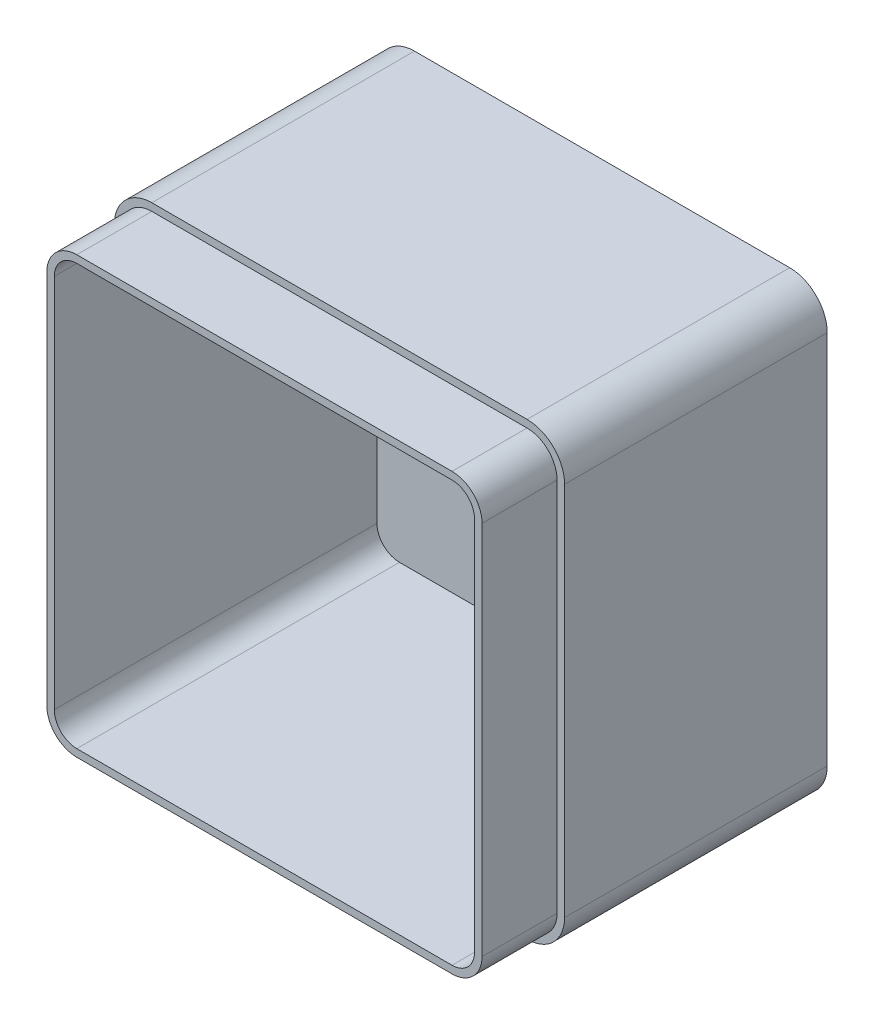
ISO-10303-21;
HEADER;
FILE_DESCRIPTION(('STEP AP214'),'2;1');
FILE_NAME('part.step','',(''),(''),'','','');
FILE_SCHEMA(('AUTOMOTIVE_DESIGN { 1 0 10303 214 1 1 1 1 }'));
ENDSEC;
DATA;
#1=APPLICATION_CONTEXT('core data for automotive mechanical design processes');
#2=APPLICATION_PROTOCOL_DEFINITION('international standard','automotive_design',2000,#1);
#3=PRODUCT_CONTEXT('',#1,'mechanical');
#4=PRODUCT('Part','Part','',(#3));
#5=PRODUCT_RELATED_PRODUCT_CATEGORY('part','',(#4));
#6=PRODUCT_DEFINITION_FORMATION('','',#4);
#7=PRODUCT_DEFINITION_CONTEXT('part definition',#1,'design');
#8=PRODUCT_DEFINITION('design','',#6,#7);
#9=PRODUCT_DEFINITION_SHAPE('','',#8);
#10=(LENGTH_UNIT() NAMED_UNIT(*) SI_UNIT(.MILLI.,.METRE.));
#11=(NAMED_UNIT(*) PLANE_ANGLE_UNIT() SI_UNIT($,.RADIAN.));
#12=(NAMED_UNIT(*) SI_UNIT($,.STERADIAN.) SOLID_ANGLE_UNIT());
#13=UNCERTAINTY_MEASURE_WITH_UNIT(LENGTH_MEASURE(1.E-05),#10,'distance_accuracy_value','');
#14=(GEOMETRIC_REPRESENTATION_CONTEXT(3) GLOBAL_UNCERTAINTY_ASSIGNED_CONTEXT((#13)) GLOBAL_UNIT_ASSIGNED_CONTEXT((#10,
#11,#12)) REPRESENTATION_CONTEXT('',''));
#15=CARTESIAN_POINT('',(0.,0.,0.));
#16=DIRECTION('',(0.,0.,1.));
#17=DIRECTION('',(1.,0.,0.));
#18=AXIS2_PLACEMENT_3D('',#15,#16,#17);
#19=CARTESIAN_POINT('',(0.,0.,90.));
#20=DIRECTION('',(0.,0.,-1.));
#21=DIRECTION('',(-1.,0.,0.));
#22=AXIS2_PLACEMENT_3D('',#19,#20,#21);
#23=PLANE('',#22);
#24=DIRECTION('',(0.,-1.,0.));
#25=VECTOR('',#24,1.);
#26=CARTESIAN_POINT('',(4.,0.,90.));
#27=LINE('',#26,#25);
#28=CARTESIAN_POINT('',(3.99999999999996,110.,90.));
#29=VERTEX_POINT('',#28);
#30=CARTESIAN_POINT('',(4.,10.,90.));
#31=VERTEX_POINT('',#30);
#32=EDGE_CURVE('E361',#29,#31,#27,.T.);
#33=ORIENTED_EDGE('',*,*,#32,.F.);
#34=CARTESIAN_POINT('',(9.99999999999996,110.,90.));
#35=DIRECTION('',(0.,0.,-1.));
#36=DIRECTION('',(-1.,0.,0.));
#37=AXIS2_PLACEMENT_3D('',#34,#35,#36);
#38=CIRCLE('',#37,6.);
#39=CARTESIAN_POINT('',(9.99999999999996,116.,90.));
#40=VERTEX_POINT('',#39);
#41=EDGE_CURVE('E339',#40,#29,#38,.F.);
#42=ORIENTED_EDGE('',*,*,#41,.F.);
#43=DIRECTION('',(-1.,0.,0.));
#44=VECTOR('',#43,1.);
#45=CARTESIAN_POINT('',(0.,116.,90.));
#46=LINE('',#45,#44);
#47=CARTESIAN_POINT('',(110.,116.,90.));
#48=VERTEX_POINT('',#47);
#49=EDGE_CURVE('E375',#48,#40,#46,.T.);
#50=ORIENTED_EDGE('',*,*,#49,.F.);
#51=CARTESIAN_POINT('',(110.,110.,90.));
#52=DIRECTION('',(0.,0.,-1.));
#53=DIRECTION('',(-1.,0.,0.));
#54=AXIS2_PLACEMENT_3D('',#51,#52,#53);
#55=CIRCLE('',#54,6.);
#56=CARTESIAN_POINT('',(116.,110.,90.));
#57=VERTEX_POINT('',#56);
#58=EDGE_CURVE('E406',#57,#48,#55,.F.);
#59=ORIENTED_EDGE('',*,*,#58,.F.);
#60=DIRECTION('',(0.,1.,0.));
#61=VECTOR('',#60,1.);
#62=CARTESIAN_POINT('',(116.,0.,90.));
#63=LINE('',#62,#61);
#64=CARTESIAN_POINT('',(116.,10.,90.));
#65=VERTEX_POINT('',#64);
#66=EDGE_CURVE('E403',#65,#57,#63,.T.);
#67=ORIENTED_EDGE('',*,*,#66,.F.);
#68=CARTESIAN_POINT('',(110.,10.,90.));
#69=DIRECTION('',(0.,0.,-1.));
#70=DIRECTION('',(-1.,0.,0.));
#71=AXIS2_PLACEMENT_3D('',#68,#69,#70);
#72=CIRCLE('',#71,6.);
#73=CARTESIAN_POINT('',(110.,4.,90.));
#74=VERTEX_POINT('',#73);
#75=EDGE_CURVE('E399',#74,#65,#72,.F.);
#76=ORIENTED_EDGE('',*,*,#75,.F.);
#77=DIRECTION('',(1.,0.,0.));
#78=VECTOR('',#77,1.);
#79=CARTESIAN_POINT('',(0.,4.,90.));
#80=LINE('',#79,#78);
#81=CARTESIAN_POINT('',(9.99999999999999,4.,90.));
#82=VERTEX_POINT('',#81);
#83=EDGE_CURVE('E396',#82,#74,#80,.T.);
#84=ORIENTED_EDGE('',*,*,#83,.F.);
#85=CARTESIAN_POINT('',(9.99999999999999,10.,90.));
#86=DIRECTION('',(0.,0.,-1.));
#87=DIRECTION('',(-1.,0.,0.));
#88=AXIS2_PLACEMENT_3D('',#85,#86,#87);
#89=CIRCLE('',#88,6.);
#90=EDGE_CURVE('E384',#31,#82,#89,.F.);
#91=ORIENTED_EDGE('',*,*,#90,.F.);
#92=EDGE_LOOP('',(#33,#42,#50,#59,#67,#76,#84,#91));
#93=FACE_BOUND('',#92,.T.);
#94=CARTESIAN_POINT('',(9.99999999999996,110.,90.));
#95=DIRECTION('',(0.,0.,1.));
#96=DIRECTION('',(1.,0.,0.));
#97=AXIS2_PLACEMENT_3D('',#94,#95,#96);
#98=CIRCLE('',#97,8.);
#99=CARTESIAN_POINT('',(9.99999999999995,118.,90.));
#100=VERTEX_POINT('',#99);
#101=CARTESIAN_POINT('',(1.99999999999996,110.,90.));
#102=VERTEX_POINT('',#101);
#103=EDGE_CURVE('E267',#100,#102,#98,.T.);
#104=ORIENTED_EDGE('',*,*,#103,.T.);
#105=DIRECTION('',(0.,-1.,0.));
#106=VECTOR('',#105,1.);
#107=CARTESIAN_POINT('',(1.99999999999996,110.,90.));
#108=LINE('',#107,#106);
#109=CARTESIAN_POINT('',(1.99999999999996,9.99999999999999,90.));
#110=VERTEX_POINT('',#109);
#111=EDGE_CURVE('E217',#102,#110,#108,.T.);
#112=ORIENTED_EDGE('',*,*,#111,.T.);
#113=CARTESIAN_POINT('',(9.99999999999999,10.,90.));
#114=DIRECTION('',(0.,0.,1.));
#115=DIRECTION('',(1.,0.,0.));
#116=AXIS2_PLACEMENT_3D('',#113,#114,#115);
#117=CIRCLE('',#116,8.00000000000001);
#118=CARTESIAN_POINT('',(9.99999999999999,1.99999999999998,90.));
#119=VERTEX_POINT('',#118);
#120=EDGE_CURVE('E66',#110,#119,#117,.T.);
#121=ORIENTED_EDGE('',*,*,#120,.T.);
#122=DIRECTION('',(1.,0.,0.));
#123=VECTOR('',#122,1.);
#124=CARTESIAN_POINT('',(9.99999999999999,2.,90.));
#125=LINE('',#124,#123);
#126=CARTESIAN_POINT('',(110.,2.,90.));
#127=VERTEX_POINT('',#126);
#128=EDGE_CURVE('E274',#119,#127,#125,.T.);
#129=ORIENTED_EDGE('',*,*,#128,.T.);
#130=CARTESIAN_POINT('',(110.,10.,90.));
#131=DIRECTION('',(0.,0.,1.));
#132=DIRECTION('',(1.,0.,0.));
#133=AXIS2_PLACEMENT_3D('',#130,#131,#132);
#134=CIRCLE('',#133,7.99999999999999);
#135=CARTESIAN_POINT('',(118.,10.,90.));
#136=VERTEX_POINT('',#135);
#137=EDGE_CURVE('E278',#127,#136,#134,.T.);
#138=ORIENTED_EDGE('',*,*,#137,.T.);
#139=DIRECTION('',(0.,1.,0.));
#140=VECTOR('',#139,1.);
#141=CARTESIAN_POINT('',(118.,9.99999999999999,90.));
#142=LINE('',#141,#140);
#143=CARTESIAN_POINT('',(118.,110.,90.));
#144=VERTEX_POINT('',#143);
#145=EDGE_CURVE('E282',#136,#144,#142,.T.);
#146=ORIENTED_EDGE('',*,*,#145,.T.);
#147=CARTESIAN_POINT('',(110.,110.,90.));
#148=DIRECTION('',(0.,0.,1.));
#149=DIRECTION('',(1.,0.,0.));
#150=AXIS2_PLACEMENT_3D('',#147,#148,#149);
#151=CIRCLE('',#150,8.00000000000001);
#152=CARTESIAN_POINT('',(110.,118.,90.));
#153=VERTEX_POINT('',#152);
#154=EDGE_CURVE('E244',#144,#153,#151,.T.);
#155=ORIENTED_EDGE('',*,*,#154,.T.);
#156=DIRECTION('',(-1.,0.,0.));
#157=VECTOR('',#156,1.);
#158=CARTESIAN_POINT('',(110.,118.,90.));
#159=LINE('',#158,#157);
#160=EDGE_CURVE('E240',#153,#100,#159,.T.);
#161=ORIENTED_EDGE('',*,*,#160,.T.);
#162=EDGE_LOOP('',(#104,#112,#121,#129,#138,#146,#155,#161));
#163=FACE_BOUND('',#162,.T.);
#164=ADVANCED_FACE('F50',(#93,#163),#23,.F.);
#165=CARTESIAN_POINT('',(4.,0.,90.));
#166=DIRECTION('',(1.,0.,0.));
#167=DIRECTION('',(0.,1.,0.));
#168=AXIS2_PLACEMENT_3D('',#165,#166,#167);
#169=PLANE('',#168);
#170=DIRECTION('',(0.,-1.,0.));
#171=VECTOR('',#170,1.);
#172=CARTESIAN_POINT('',(4.,0.,4.));
#173=LINE('',#172,#171);
#174=CARTESIAN_POINT('',(3.99999999999996,110.,4.));
#175=VERTEX_POINT('',#174);
#176=CARTESIAN_POINT('',(4.,10.,4.));
#177=VERTEX_POINT('',#176);
#178=EDGE_CURVE('E331',#175,#177,#173,.T.);
#179=ORIENTED_EDGE('',*,*,#178,.F.);
#180=DIRECTION('',(0.,0.,1.));
#181=VECTOR('',#180,1.);
#182=CARTESIAN_POINT('',(3.99999999999996,110.,90.));
#183=LINE('',#182,#181);
#184=EDGE_CURVE('E340',#29,#175,#183,.F.);
#185=ORIENTED_EDGE('',*,*,#184,.F.);
#186=ORIENTED_EDGE('',*,*,#32,.T.);
#187=DIRECTION('',(0.,0.,1.));
#188=VECTOR('',#187,1.);
#189=CARTESIAN_POINT('',(4.,10.,90.));
#190=LINE('',#189,#188);
#191=EDGE_CURVE('E336',#177,#31,#190,.T.);
#192=ORIENTED_EDGE('',*,*,#191,.F.);
#193=EDGE_LOOP('',(#179,#185,#186,#192));
#194=FACE_BOUND('',#193,.T.);
#195=ADVANCED_FACE('F515',(#194),#169,.T.);
#196=CARTESIAN_POINT('',(0.,4.,90.));
#197=DIRECTION('',(0.,1.,0.));
#198=DIRECTION('',(0.,0.,1.));
#199=AXIS2_PLACEMENT_3D('',#196,#197,#198);
#200=PLANE('',#199);
#201=ORIENTED_EDGE('',*,*,#83,.T.);
#202=DIRECTION('',(0.,0.,1.));
#203=VECTOR('',#202,1.);
#204=CARTESIAN_POINT('',(110.,4.,90.));
#205=LINE('',#204,#203);
#206=CARTESIAN_POINT('',(110.,4.,4.));
#207=VERTEX_POINT('',#206);
#208=EDGE_CURVE('E372',#207,#74,#205,.T.);
#209=ORIENTED_EDGE('',*,*,#208,.F.);
#210=DIRECTION('',(1.,0.,0.));
#211=VECTOR('',#210,1.);
#212=CARTESIAN_POINT('',(0.,4.,4.));
#213=LINE('',#212,#211);
#214=CARTESIAN_POINT('',(9.99999999999999,4.,4.));
#215=VERTEX_POINT('',#214);
#216=EDGE_CURVE('E335',#215,#207,#213,.T.);
#217=ORIENTED_EDGE('',*,*,#216,.F.);
#218=DIRECTION('',(0.,0.,1.));
#219=VECTOR('',#218,1.);
#220=CARTESIAN_POINT('',(9.99999999999999,4.,90.));
#221=LINE('',#220,#219);
#222=EDGE_CURVE('E356',#82,#215,#221,.F.);
#223=ORIENTED_EDGE('',*,*,#222,.F.);
#224=EDGE_LOOP('',(#201,#209,#217,#223));
#225=FACE_BOUND('',#224,.T.);
#226=ADVANCED_FACE('F520',(#225),#200,.T.);
#227=CARTESIAN_POINT('',(116.,0.,90.));
#228=DIRECTION('',(-1.,0.,0.));
#229=DIRECTION('',(0.,-1.,0.));
#230=AXIS2_PLACEMENT_3D('',#227,#228,#229);
#231=PLANE('',#230);
#232=ORIENTED_EDGE('',*,*,#66,.T.);
#233=DIRECTION('',(0.,0.,1.));
#234=VECTOR('',#233,1.);
#235=CARTESIAN_POINT('',(116.,110.,90.));
#236=LINE('',#235,#234);
#237=CARTESIAN_POINT('',(116.,110.,4.));
#238=VERTEX_POINT('',#237);
#239=EDGE_CURVE('E381',#238,#57,#236,.T.);
#240=ORIENTED_EDGE('',*,*,#239,.F.);
#241=DIRECTION('',(0.,1.,0.));
#242=VECTOR('',#241,1.);
#243=CARTESIAN_POINT('',(116.,0.,4.));
#244=LINE('',#243,#242);
#245=CARTESIAN_POINT('',(116.,10.,4.));
#246=VERTEX_POINT('',#245);
#247=EDGE_CURVE('E348',#246,#238,#244,.T.);
#248=ORIENTED_EDGE('',*,*,#247,.F.);
#249=DIRECTION('',(0.,0.,1.));
#250=VECTOR('',#249,1.);
#251=CARTESIAN_POINT('',(116.,10.,90.));
#252=LINE('',#251,#250);
#253=EDGE_CURVE('E376',#65,#246,#252,.F.);
#254=ORIENTED_EDGE('',*,*,#253,.F.);
#255=EDGE_LOOP('',(#232,#240,#248,#254));
#256=FACE_BOUND('',#255,.T.);
#257=ADVANCED_FACE('F549',(#256),#231,.T.);
#258=CARTESIAN_POINT('',(0.,116.,90.));
#259=DIRECTION('',(0.,-1.,0.));
#260=DIRECTION('',(0.,0.,-1.));
#261=AXIS2_PLACEMENT_3D('',#258,#259,#260);
#262=PLANE('',#261);
#263=ORIENTED_EDGE('',*,*,#49,.T.);
#264=DIRECTION('',(0.,0.,-1.));
#265=VECTOR('',#264,1.);
#266=CARTESIAN_POINT('',(9.99999999999996,116.,90.));
#267=LINE('',#266,#265);
#268=CARTESIAN_POINT('',(9.99999999999996,116.,4.));
#269=VERTEX_POINT('',#268);
#270=EDGE_CURVE('E380',#269,#40,#267,.F.);
#271=ORIENTED_EDGE('',*,*,#270,.F.);
#272=DIRECTION('',(-1.,0.,0.));
#273=VECTOR('',#272,1.);
#274=CARTESIAN_POINT('',(0.,116.,4.));
#275=LINE('',#274,#273);
#276=CARTESIAN_POINT('',(110.,116.,4.));
#277=VERTEX_POINT('',#276);
#278=EDGE_CURVE('E357',#277,#269,#275,.T.);
#279=ORIENTED_EDGE('',*,*,#278,.F.);
#280=DIRECTION('',(0.,0.,-1.));
#281=VECTOR('',#280,1.);
#282=CARTESIAN_POINT('',(110.,116.,90.));
#283=LINE('',#282,#281);
#284=EDGE_CURVE('E385',#48,#277,#283,.T.);
#285=ORIENTED_EDGE('',*,*,#284,.F.);
#286=EDGE_LOOP('',(#263,#271,#279,#285));
#287=FACE_BOUND('',#286,.T.);
#288=ADVANCED_FACE('F545',(#287),#262,.T.);
#289=CARTESIAN_POINT('',(0.,0.,4.));
#290=DIRECTION('',(0.,0.,-1.));
#291=DIRECTION('',(-1.,0.,0.));
#292=AXIS2_PLACEMENT_3D('',#289,#290,#291);
#293=PLANE('',#292);
#294=ORIENTED_EDGE('',*,*,#216,.T.);
#295=CARTESIAN_POINT('',(110.,10.,4.));
#296=DIRECTION('',(0.,0.,-1.));
#297=DIRECTION('',(-1.,0.,0.));
#298=AXIS2_PLACEMENT_3D('',#295,#296,#297);
#299=CIRCLE('',#298,6.);
#300=EDGE_CURVE('E351',#246,#207,#299,.T.);
#301=ORIENTED_EDGE('',*,*,#300,.F.);
#302=ORIENTED_EDGE('',*,*,#247,.T.);
#303=CARTESIAN_POINT('',(110.,110.,4.));
#304=DIRECTION('',(0.,0.,-1.));
#305=DIRECTION('',(-1.,0.,0.));
#306=AXIS2_PLACEMENT_3D('',#303,#304,#305);
#307=CIRCLE('',#306,6.);
#308=EDGE_CURVE('E355',#277,#238,#307,.T.);
#309=ORIENTED_EDGE('',*,*,#308,.F.);
#310=ORIENTED_EDGE('',*,*,#278,.T.);
#311=CARTESIAN_POINT('',(9.99999999999996,110.,4.));
#312=DIRECTION('',(0.,0.,-1.));
#313=DIRECTION('',(-1.,0.,0.));
#314=AXIS2_PLACEMENT_3D('',#311,#312,#313);
#315=CIRCLE('',#314,6.);
#316=EDGE_CURVE('E352',#175,#269,#315,.T.);
#317=ORIENTED_EDGE('',*,*,#316,.F.);
#318=ORIENTED_EDGE('',*,*,#178,.T.);
#319=CARTESIAN_POINT('',(9.99999999999999,10.,4.));
#320=DIRECTION('',(0.,0.,-1.));
#321=DIRECTION('',(-1.,0.,0.));
#322=AXIS2_PLACEMENT_3D('',#319,#320,#321);
#323=CIRCLE('',#322,6.);
#324=EDGE_CURVE('E344',#215,#177,#323,.T.);
#325=ORIENTED_EDGE('',*,*,#324,.F.);
#326=EDGE_LOOP('',(#294,#301,#302,#309,#310,#317,#318,#325));
#327=FACE_BOUND('',#326,.T.);
#328=ADVANCED_FACE('F541',(#327),#293,.F.);
#329=CARTESIAN_POINT('',(9.99999999999999,10.,90.));
#330=DIRECTION('',(0.,0.,-1.));
#331=DIRECTION('',(-1.,0.,0.));
#332=AXIS2_PLACEMENT_3D('',#329,#330,#331);
#333=CYLINDRICAL_SURFACE('',#332,6.);
#334=ORIENTED_EDGE('',*,*,#90,.T.);
#335=ORIENTED_EDGE('',*,*,#222,.T.);
#336=ORIENTED_EDGE('',*,*,#324,.T.);
#337=ORIENTED_EDGE('',*,*,#191,.T.);
#338=EDGE_LOOP('',(#334,#335,#336,#337));
#339=FACE_BOUND('',#338,.T.);
#340=ADVANCED_FACE('F537',(#339),#333,.F.);
#341=CARTESIAN_POINT('',(110.,10.,90.));
#342=DIRECTION('',(0.,0.,-1.));
#343=DIRECTION('',(-1.,0.,0.));
#344=AXIS2_PLACEMENT_3D('',#341,#342,#343);
#345=CYLINDRICAL_SURFACE('',#344,6.);
#346=ORIENTED_EDGE('',*,*,#75,.T.);
#347=ORIENTED_EDGE('',*,*,#253,.T.);
#348=ORIENTED_EDGE('',*,*,#300,.T.);
#349=ORIENTED_EDGE('',*,*,#208,.T.);
#350=EDGE_LOOP('',(#346,#347,#348,#349));
#351=FACE_BOUND('',#350,.T.);
#352=ADVANCED_FACE('F533',(#351),#345,.F.);
#353=CARTESIAN_POINT('',(110.,110.,90.));
#354=DIRECTION('',(0.,0.,-1.));
#355=DIRECTION('',(-1.,0.,0.));
#356=AXIS2_PLACEMENT_3D('',#353,#354,#355);
#357=CYLINDRICAL_SURFACE('',#356,6.);
#358=ORIENTED_EDGE('',*,*,#58,.T.);
#359=ORIENTED_EDGE('',*,*,#284,.T.);
#360=ORIENTED_EDGE('',*,*,#308,.T.);
#361=ORIENTED_EDGE('',*,*,#239,.T.);
#362=EDGE_LOOP('',(#358,#359,#360,#361));
#363=FACE_BOUND('',#362,.T.);
#364=ADVANCED_FACE('F529',(#363),#357,.F.);
#365=CARTESIAN_POINT('',(9.99999999999996,110.,90.));
#366=DIRECTION('',(0.,0.,-1.));
#367=DIRECTION('',(-1.,0.,0.));
#368=AXIS2_PLACEMENT_3D('',#365,#366,#367);
#369=CYLINDRICAL_SURFACE('',#368,6.);
#370=ORIENTED_EDGE('',*,*,#41,.T.);
#371=ORIENTED_EDGE('',*,*,#184,.T.);
#372=ORIENTED_EDGE('',*,*,#316,.T.);
#373=ORIENTED_EDGE('',*,*,#270,.T.);
#374=EDGE_LOOP('',(#370,#371,#372,#373));
#375=FACE_BOUND('',#374,.T.);
#376=ADVANCED_FACE('F526',(#375),#369,.F.);
#377=CARTESIAN_POINT('',(9.99999999999996,110.,70.));
#378=DIRECTION('',(0.,0.,1.));
#379=DIRECTION('',(1.,0.,0.));
#380=AXIS2_PLACEMENT_3D('',#377,#378,#379);
#381=PLANE('',#380);
#382=DIRECTION('',(-1.,0.,0.));
#383=VECTOR('',#382,1.);
#384=CARTESIAN_POINT('',(110.,118.,70.));
#385=LINE('',#384,#383);
#386=CARTESIAN_POINT('',(110.,118.,70.));
#387=VERTEX_POINT('',#386);
#388=CARTESIAN_POINT('',(9.99999999999995,118.,70.));
#389=VERTEX_POINT('',#388);
#390=EDGE_CURVE('E224',#387,#389,#385,.T.);
#391=ORIENTED_EDGE('',*,*,#390,.F.);
#392=CARTESIAN_POINT('',(110.,110.,70.));
#393=DIRECTION('',(0.,0.,1.));
#394=DIRECTION('',(1.,0.,0.));
#395=AXIS2_PLACEMENT_3D('',#392,#393,#394);
#396=CIRCLE('',#395,8.00000000000001);
#397=CARTESIAN_POINT('',(118.,110.,70.));
#398=VERTEX_POINT('',#397);
#399=EDGE_CURVE('E261',#398,#387,#396,.T.);
#400=ORIENTED_EDGE('',*,*,#399,.F.);
#401=DIRECTION('',(0.,1.,0.));
#402=VECTOR('',#401,1.);
#403=CARTESIAN_POINT('',(118.,9.99999999999999,70.));
#404=LINE('',#403,#402);
#405=CARTESIAN_POINT('',(118.,10.,70.));
#406=VERTEX_POINT('',#405);
#407=EDGE_CURVE('E257',#406,#398,#404,.T.);
#408=ORIENTED_EDGE('',*,*,#407,.F.);
#409=CARTESIAN_POINT('',(110.,10.,70.));
#410=DIRECTION('',(0.,0.,1.));
#411=DIRECTION('',(1.,0.,0.));
#412=AXIS2_PLACEMENT_3D('',#409,#410,#411);
#413=CIRCLE('',#412,7.99999999999999);
#414=CARTESIAN_POINT('',(110.,2.,70.));
#415=VERTEX_POINT('',#414);
#416=EDGE_CURVE('E253',#415,#406,#413,.T.);
#417=ORIENTED_EDGE('',*,*,#416,.F.);
#418=DIRECTION('',(1.,0.,0.));
#419=VECTOR('',#418,1.);
#420=CARTESIAN_POINT('',(9.99999999999999,2.,70.));
#421=LINE('',#420,#419);
#422=CARTESIAN_POINT('',(9.99999999999999,1.99999999999998,70.));
#423=VERTEX_POINT('',#422);
#424=EDGE_CURVE('E249',#423,#415,#421,.T.);
#425=ORIENTED_EDGE('',*,*,#424,.F.);
#426=CARTESIAN_POINT('',(9.99999999999999,10.,70.));
#427=DIRECTION('',(0.,0.,1.));
#428=DIRECTION('',(1.,0.,0.));
#429=AXIS2_PLACEMENT_3D('',#426,#427,#428);
#430=CIRCLE('',#429,8.00000000000001);
#431=CARTESIAN_POINT('',(1.99999999999996,9.99999999999999,70.));
#432=VERTEX_POINT('',#431);
#433=EDGE_CURVE('E234',#432,#423,#430,.T.);
#434=ORIENTED_EDGE('',*,*,#433,.F.);
#435=DIRECTION('',(0.,-1.,0.));
#436=VECTOR('',#435,1.);
#437=CARTESIAN_POINT('',(1.99999999999996,110.,70.));
#438=LINE('',#437,#436);
#439=CARTESIAN_POINT('',(1.99999999999996,110.,70.));
#440=VERTEX_POINT('',#439);
#441=EDGE_CURVE('E215',#440,#432,#438,.T.);
#442=ORIENTED_EDGE('',*,*,#441,.F.);
#443=CARTESIAN_POINT('',(9.99999999999996,110.,70.));
#444=DIRECTION('',(0.,0.,1.));
#445=DIRECTION('',(1.,0.,0.));
#446=AXIS2_PLACEMENT_3D('',#443,#444,#445);
#447=CIRCLE('',#446,8.);
#448=EDGE_CURVE('E230',#389,#440,#447,.T.);
#449=ORIENTED_EDGE('',*,*,#448,.F.);
#450=EDGE_LOOP('',(#391,#400,#408,#417,#425,#434,#442,#449));
#451=FACE_BOUND('',#450,.T.);
#452=CARTESIAN_POINT('',(9.99999999999996,110.,70.));
#453=DIRECTION('',(0.,0.,1.));
#454=DIRECTION('',(1.,0.,0.));
#455=AXIS2_PLACEMENT_3D('',#452,#453,#454);
#456=CIRCLE('',#455,10.);
#457=CARTESIAN_POINT('',(9.99999999999996,120.,70.));
#458=VERTEX_POINT('',#457);
#459=CARTESIAN_POINT('',(0.,110.,70.));
#460=VERTEX_POINT('',#459);
#461=EDGE_CURVE('E291',#458,#460,#456,.T.);
#462=ORIENTED_EDGE('',*,*,#461,.T.);
#463=DIRECTION('',(0.,-1.,0.));
#464=VECTOR('',#463,1.);
#465=CARTESIAN_POINT('',(0.,110.,70.));
#466=LINE('',#465,#464);
#467=CARTESIAN_POINT('',(0.,9.99999999999999,70.));
#468=VERTEX_POINT('',#467);
#469=EDGE_CURVE('E311',#460,#468,#466,.T.);
#470=ORIENTED_EDGE('',*,*,#469,.T.);
#471=CARTESIAN_POINT('',(9.99999999999999,10.,70.));
#472=DIRECTION('',(0.,0.,1.));
#473=DIRECTION('',(1.,0.,0.));
#474=AXIS2_PLACEMENT_3D('',#471,#472,#473);
#475=CIRCLE('',#474,10.);
#476=CARTESIAN_POINT('',(9.99999999999999,0.,70.));
#477=VERTEX_POINT('',#476);
#478=EDGE_CURVE('E314',#468,#477,#475,.T.);
#479=ORIENTED_EDGE('',*,*,#478,.T.);
#480=DIRECTION('',(1.,0.,0.));
#481=VECTOR('',#480,1.);
#482=CARTESIAN_POINT('',(9.99999999999999,0.,70.));
#483=LINE('',#482,#481);
#484=CARTESIAN_POINT('',(110.,0.,70.));
#485=VERTEX_POINT('',#484);
#486=EDGE_CURVE('E317',#477,#485,#483,.T.);
#487=ORIENTED_EDGE('',*,*,#486,.T.);
#488=CARTESIAN_POINT('',(110.,10.,70.));
#489=DIRECTION('',(0.,0.,1.));
#490=DIRECTION('',(1.,0.,0.));
#491=AXIS2_PLACEMENT_3D('',#488,#489,#490);
#492=CIRCLE('',#491,9.99999999999999);
#493=CARTESIAN_POINT('',(120.,10.,70.));
#494=VERTEX_POINT('',#493);
#495=EDGE_CURVE('E320',#485,#494,#492,.T.);
#496=ORIENTED_EDGE('',*,*,#495,.T.);
#497=DIRECTION('',(0.,1.,0.));
#498=VECTOR('',#497,1.);
#499=CARTESIAN_POINT('',(120.,10.,70.));
#500=LINE('',#499,#498);
#501=CARTESIAN_POINT('',(120.,110.,70.));
#502=VERTEX_POINT('',#501);
#503=EDGE_CURVE('E323',#494,#502,#500,.T.);
#504=ORIENTED_EDGE('',*,*,#503,.T.);
#505=CARTESIAN_POINT('',(110.,110.,70.));
#506=DIRECTION('',(0.,0.,1.));
#507=DIRECTION('',(1.,0.,0.));
#508=AXIS2_PLACEMENT_3D('',#505,#506,#507);
#509=CIRCLE('',#508,9.99999999999999);
#510=CARTESIAN_POINT('',(110.,120.,70.));
#511=VERTEX_POINT('',#510);
#512=EDGE_CURVE('E326',#502,#511,#509,.T.);
#513=ORIENTED_EDGE('',*,*,#512,.T.);
#514=DIRECTION('',(-1.,0.,0.));
#515=VECTOR('',#514,1.);
#516=CARTESIAN_POINT('',(110.,120.,70.));
#517=LINE('',#516,#515);
#518=EDGE_CURVE('E74',#511,#458,#517,.T.);
#519=ORIENTED_EDGE('',*,*,#518,.T.);
#520=EDGE_LOOP('',(#462,#470,#479,#487,#496,#504,#513,#519));
#521=FACE_BOUND('',#520,.T.);
#522=ADVANCED_FACE('F229',(#451,#521),#381,.T.);
#523=CARTESIAN_POINT('',(9.99999999999996,110.,70.));
#524=DIRECTION('',(0.,0.,1.));
#525=DIRECTION('',(1.,0.,0.));
#526=AXIS2_PLACEMENT_3D('',#523,#524,#525);
#527=CYLINDRICAL_SURFACE('',#526,8.);
#528=ORIENTED_EDGE('',*,*,#103,.F.);
#529=DIRECTION('',(0.,0.,1.));
#530=VECTOR('',#529,1.);
#531=CARTESIAN_POINT('',(9.99999999999995,118.,70.));
#532=LINE('',#531,#530);
#533=EDGE_CURVE('E238',#389,#100,#532,.T.);
#534=ORIENTED_EDGE('',*,*,#533,.F.);
#535=ORIENTED_EDGE('',*,*,#448,.T.);
#536=DIRECTION('',(0.,0.,1.));
#537=VECTOR('',#536,1.);
#538=CARTESIAN_POINT('',(1.99999999999996,110.,70.));
#539=LINE('',#538,#537);
#540=EDGE_CURVE('E212',#440,#102,#539,.T.);
#541=ORIENTED_EDGE('',*,*,#540,.T.);
#542=EDGE_LOOP('',(#528,#534,#535,#541));
#543=FACE_BOUND('',#542,.T.);
#544=ADVANCED_FACE('F237',(#543),#527,.T.);
#545=CARTESIAN_POINT('',(110.,118.,70.));
#546=DIRECTION('',(0.,1.,0.));
#547=DIRECTION('',(0.,0.,1.));
#548=AXIS2_PLACEMENT_3D('',#545,#546,#547);
#549=PLANE('',#548);
#550=ORIENTED_EDGE('',*,*,#160,.F.);
#551=DIRECTION('',(0.,0.,1.));
#552=VECTOR('',#551,1.);
#553=CARTESIAN_POINT('',(110.,118.,70.));
#554=LINE('',#553,#552);
#555=EDGE_CURVE('E292',#387,#153,#554,.T.);
#556=ORIENTED_EDGE('',*,*,#555,.F.);
#557=ORIENTED_EDGE('',*,*,#390,.T.);
#558=ORIENTED_EDGE('',*,*,#533,.T.);
#559=EDGE_LOOP('',(#550,#556,#557,#558));
#560=FACE_BOUND('',#559,.T.);
#561=ADVANCED_FACE('F560',(#560),#549,.T.);
#562=CARTESIAN_POINT('',(110.,110.,70.));
#563=DIRECTION('',(0.,0.,1.));
#564=DIRECTION('',(1.,0.,0.));
#565=AXIS2_PLACEMENT_3D('',#562,#563,#564);
#566=CYLINDRICAL_SURFACE('',#565,8.00000000000001);
#567=ORIENTED_EDGE('',*,*,#154,.F.);
#568=DIRECTION('',(0.,0.,1.));
#569=VECTOR('',#568,1.);
#570=CARTESIAN_POINT('',(118.,110.,70.));
#571=LINE('',#570,#569);
#572=EDGE_CURVE('E295',#398,#144,#571,.T.);
#573=ORIENTED_EDGE('',*,*,#572,.F.);
#574=ORIENTED_EDGE('',*,*,#399,.T.);
#575=ORIENTED_EDGE('',*,*,#555,.T.);
#576=EDGE_LOOP('',(#567,#573,#574,#575));
#577=FACE_BOUND('',#576,.T.);
#578=ADVANCED_FACE('F575',(#577),#566,.T.);
#579=CARTESIAN_POINT('',(118.,9.99999999999999,70.));
#580=DIRECTION('',(1.,0.,0.));
#581=DIRECTION('',(0.,0.,-1.));
#582=AXIS2_PLACEMENT_3D('',#579,#580,#581);
#583=PLANE('',#582);
#584=ORIENTED_EDGE('',*,*,#145,.F.);
#585=DIRECTION('',(0.,0.,1.));
#586=VECTOR('',#585,1.);
#587=CARTESIAN_POINT('',(118.,10.,70.));
#588=LINE('',#587,#586);
#589=EDGE_CURVE('E298',#406,#136,#588,.T.);
#590=ORIENTED_EDGE('',*,*,#589,.F.);
#591=ORIENTED_EDGE('',*,*,#407,.T.);
#592=ORIENTED_EDGE('',*,*,#572,.T.);
#593=EDGE_LOOP('',(#584,#590,#591,#592));
#594=FACE_BOUND('',#593,.T.);
#595=ADVANCED_FACE('F571',(#594),#583,.T.);
#596=CARTESIAN_POINT('',(110.,10.,70.));
#597=DIRECTION('',(0.,0.,1.));
#598=DIRECTION('',(1.,0.,0.));
#599=AXIS2_PLACEMENT_3D('',#596,#597,#598);
#600=CYLINDRICAL_SURFACE('',#599,7.99999999999999);
#601=ORIENTED_EDGE('',*,*,#137,.F.);
#602=DIRECTION('',(0.,0.,1.));
#603=VECTOR('',#602,1.);
#604=CARTESIAN_POINT('',(110.,2.,70.));
#605=LINE('',#604,#603);
#606=EDGE_CURVE('E301',#415,#127,#605,.T.);
#607=ORIENTED_EDGE('',*,*,#606,.F.);
#608=ORIENTED_EDGE('',*,*,#416,.T.);
#609=ORIENTED_EDGE('',*,*,#589,.T.);
#610=EDGE_LOOP('',(#601,#607,#608,#609));
#611=FACE_BOUND('',#610,.T.);
#612=ADVANCED_FACE('F567',(#611),#600,.T.);
#613=CARTESIAN_POINT('',(9.99999999999999,2.,70.));
#614=DIRECTION('',(0.,-1.,0.));
#615=DIRECTION('',(0.,0.,-1.));
#616=AXIS2_PLACEMENT_3D('',#613,#614,#615);
#617=PLANE('',#616);
#618=ORIENTED_EDGE('',*,*,#128,.F.);
#619=DIRECTION('',(0.,0.,1.));
#620=VECTOR('',#619,1.);
#621=CARTESIAN_POINT('',(9.99999999999999,1.99999999999998,70.));
#622=LINE('',#621,#620);
#623=EDGE_CURVE('E304',#423,#119,#622,.T.);
#624=ORIENTED_EDGE('',*,*,#623,.F.);
#625=ORIENTED_EDGE('',*,*,#424,.T.);
#626=ORIENTED_EDGE('',*,*,#606,.T.);
#627=EDGE_LOOP('',(#618,#624,#625,#626));
#628=FACE_BOUND('',#627,.T.);
#629=ADVANCED_FACE('F564',(#628),#617,.T.);
#630=CARTESIAN_POINT('',(9.99999999999999,10.,70.));
#631=DIRECTION('',(0.,0.,1.));
#632=DIRECTION('',(1.,0.,0.));
#633=AXIS2_PLACEMENT_3D('',#630,#631,#632);
#634=CYLINDRICAL_SURFACE('',#633,8.00000000000001);
#635=ORIENTED_EDGE('',*,*,#120,.F.);
#636=DIRECTION('',(0.,0.,1.));
#637=VECTOR('',#636,1.);
#638=CARTESIAN_POINT('',(1.99999999999996,9.99999999999999,70.));
#639=LINE('',#638,#637);
#640=EDGE_CURVE('E223',#432,#110,#639,.T.);
#641=ORIENTED_EDGE('',*,*,#640,.F.);
#642=ORIENTED_EDGE('',*,*,#433,.T.);
#643=ORIENTED_EDGE('',*,*,#623,.T.);
#644=EDGE_LOOP('',(#635,#641,#642,#643));
#645=FACE_BOUND('',#644,.T.);
#646=ADVANCED_FACE('F510',(#645),#634,.T.);
#647=CARTESIAN_POINT('',(1.99999999999996,110.,70.));
#648=DIRECTION('',(-1.,0.,0.));
#649=DIRECTION('',(0.,0.,1.));
#650=AXIS2_PLACEMENT_3D('',#647,#648,#649);
#651=PLANE('',#650);
#652=ORIENTED_EDGE('',*,*,#111,.F.);
#653=ORIENTED_EDGE('',*,*,#540,.F.);
#654=ORIENTED_EDGE('',*,*,#441,.T.);
#655=ORIENTED_EDGE('',*,*,#640,.T.);
#656=EDGE_LOOP('',(#652,#653,#654,#655));
#657=FACE_BOUND('',#656,.T.);
#658=ADVANCED_FACE('F214',(#657),#651,.T.);
#659=CARTESIAN_POINT('',(0.,0.,0.));
#660=DIRECTION('',(0.,0.,-1.));
#661=DIRECTION('',(-1.,0.,0.));
#662=AXIS2_PLACEMENT_3D('',#659,#660,#661);
#663=PLANE('',#662);
#664=DIRECTION('',(1.,0.,0.));
#665=VECTOR('',#664,1.);
#666=CARTESIAN_POINT('',(0.,0.,0.));
#667=LINE('',#666,#665);
#668=CARTESIAN_POINT('',(9.99999999999999,0.,0.));
#669=VERTEX_POINT('',#668);
#670=CARTESIAN_POINT('',(110.,0.,0.));
#671=VERTEX_POINT('',#670);
#672=EDGE_CURVE('E419',#669,#671,#667,.T.);
#673=ORIENTED_EDGE('',*,*,#672,.F.);
#674=CARTESIAN_POINT('',(9.99999999999999,10.,0.));
#675=DIRECTION('',(0.,0.,-1.));
#676=DIRECTION('',(-1.,0.,0.));
#677=AXIS2_PLACEMENT_3D('',#674,#675,#676);
#678=CIRCLE('',#677,10.);
#679=CARTESIAN_POINT('',(0.,9.99999999999999,0.));
#680=VERTEX_POINT('',#679);
#681=EDGE_CURVE('E447',#669,#680,#678,.T.);
#682=ORIENTED_EDGE('',*,*,#681,.T.);
#683=DIRECTION('',(0.,-1.,0.));
#684=VECTOR('',#683,1.);
#685=CARTESIAN_POINT('',(0.,0.,0.));
#686=LINE('',#685,#684);
#687=CARTESIAN_POINT('',(0.,110.,0.));
#688=VERTEX_POINT('',#687);
#689=EDGE_CURVE('E389',#688,#680,#686,.T.);
#690=ORIENTED_EDGE('',*,*,#689,.F.);
#691=CARTESIAN_POINT('',(9.99999999999996,110.,0.));
#692=DIRECTION('',(0.,0.,-1.));
#693=DIRECTION('',(-1.,0.,0.));
#694=AXIS2_PLACEMENT_3D('',#691,#692,#693);
#695=CIRCLE('',#694,10.);
#696=CARTESIAN_POINT('',(9.99999999999996,120.,0.));
#697=VERTEX_POINT('',#696);
#698=EDGE_CURVE('E438',#688,#697,#695,.T.);
#699=ORIENTED_EDGE('',*,*,#698,.T.);
#700=DIRECTION('',(-1.,0.,0.));
#701=VECTOR('',#700,1.);
#702=CARTESIAN_POINT('',(0.,120.,0.));
#703=LINE('',#702,#701);
#704=CARTESIAN_POINT('',(110.,120.,0.));
#705=VERTEX_POINT('',#704);
#706=EDGE_CURVE('E427',#705,#697,#703,.T.);
#707=ORIENTED_EDGE('',*,*,#706,.F.);
#708=CARTESIAN_POINT('',(110.,110.,0.));
#709=DIRECTION('',(0.,0.,-1.));
#710=DIRECTION('',(-1.,0.,0.));
#711=AXIS2_PLACEMENT_3D('',#708,#709,#710);
#712=CIRCLE('',#711,10.);
#713=CARTESIAN_POINT('',(120.,110.,0.));
#714=VERTEX_POINT('',#713);
#715=EDGE_CURVE('E441',#705,#714,#712,.T.);
#716=ORIENTED_EDGE('',*,*,#715,.T.);
#717=DIRECTION('',(0.,1.,0.));
#718=VECTOR('',#717,1.);
#719=CARTESIAN_POINT('',(120.,0.,0.));
#720=LINE('',#719,#718);
#721=CARTESIAN_POINT('',(120.,10.,0.));
#722=VERTEX_POINT('',#721);
#723=EDGE_CURVE('E423',#722,#714,#720,.T.);
#724=ORIENTED_EDGE('',*,*,#723,.F.);
#725=CARTESIAN_POINT('',(110.,10.,0.));
#726=DIRECTION('',(0.,0.,-1.));
#727=DIRECTION('',(-1.,0.,0.));
#728=AXIS2_PLACEMENT_3D('',#725,#726,#727);
#729=CIRCLE('',#728,10.);
#730=EDGE_CURVE('E444',#722,#671,#729,.T.);
#731=ORIENTED_EDGE('',*,*,#730,.T.);
#732=EDGE_LOOP('',(#673,#682,#690,#699,#707,#716,#724,#731));
#733=FACE_BOUND('',#732,.T.);
#734=ADVANCED_FACE('F503',(#733),#663,.T.);
#735=CARTESIAN_POINT('',(9.99999999999996,110.,90.));
#736=DIRECTION('',(0.,0.,-1.));
#737=DIRECTION('',(-1.,0.,0.));
#738=AXIS2_PLACEMENT_3D('',#735,#736,#737);
#739=CYLINDRICAL_SURFACE('',#738,10.);
#740=DIRECTION('',(0.,0.,-1.));
#741=VECTOR('',#740,1.);
#742=CARTESIAN_POINT('',(0.,110.,90.));
#743=LINE('',#742,#741);
#744=EDGE_CURVE('E450',#460,#688,#743,.T.);
#745=ORIENTED_EDGE('',*,*,#744,.F.);
#746=ORIENTED_EDGE('',*,*,#461,.F.);
#747=DIRECTION('',(0.,0.,-1.));
#748=VECTOR('',#747,1.);
#749=CARTESIAN_POINT('',(9.99999999999996,120.,90.));
#750=LINE('',#749,#748);
#751=EDGE_CURVE('E59',#697,#458,#750,.F.);
#752=ORIENTED_EDGE('',*,*,#751,.F.);
#753=ORIENTED_EDGE('',*,*,#698,.F.);
#754=EDGE_LOOP('',(#745,#746,#752,#753));
#755=FACE_BOUND('',#754,.T.);
#756=ADVANCED_FACE('F52',(#755),#739,.T.);
#757=CARTESIAN_POINT('',(110.,110.,90.));
#758=DIRECTION('',(0.,0.,-1.));
#759=DIRECTION('',(-1.,0.,0.));
#760=AXIS2_PLACEMENT_3D('',#757,#758,#759);
#761=CYLINDRICAL_SURFACE('',#760,10.);
#762=DIRECTION('',(0.,0.,-1.));
#763=VECTOR('',#762,1.);
#764=CARTESIAN_POINT('',(110.,120.,90.));
#765=LINE('',#764,#763);
#766=EDGE_CURVE('E12',#511,#705,#765,.T.);
#767=ORIENTED_EDGE('',*,*,#766,.F.);
#768=ORIENTED_EDGE('',*,*,#512,.F.);
#769=DIRECTION('',(0.,0.,-1.));
#770=VECTOR('',#769,1.);
#771=CARTESIAN_POINT('',(120.,110.,90.));
#772=LINE('',#771,#770);
#773=EDGE_CURVE('E457',#714,#502,#772,.F.);
#774=ORIENTED_EDGE('',*,*,#773,.F.);
#775=ORIENTED_EDGE('',*,*,#715,.F.);
#776=EDGE_LOOP('',(#767,#768,#774,#775));
#777=FACE_BOUND('',#776,.T.);
#778=ADVANCED_FACE('F501',(#777),#761,.T.);
#779=CARTESIAN_POINT('',(0.,120.,90.));
#780=DIRECTION('',(0.,-1.,0.));
#781=DIRECTION('',(0.,0.,-1.));
#782=AXIS2_PLACEMENT_3D('',#779,#780,#781);
#783=PLANE('',#782);
#784=ORIENTED_EDGE('',*,*,#518,.F.);
#785=ORIENTED_EDGE('',*,*,#766,.T.);
#786=ORIENTED_EDGE('',*,*,#706,.T.);
#787=ORIENTED_EDGE('',*,*,#751,.T.);
#788=EDGE_LOOP('',(#784,#785,#786,#787));
#789=FACE_BOUND('',#788,.T.);
#790=ADVANCED_FACE('F467',(#789),#783,.F.);
#791=CARTESIAN_POINT('',(110.,10.,90.));
#792=DIRECTION('',(0.,0.,-1.));
#793=DIRECTION('',(-1.,0.,0.));
#794=AXIS2_PLACEMENT_3D('',#791,#792,#793);
#795=CYLINDRICAL_SURFACE('',#794,10.);
#796=DIRECTION('',(0.,0.,-1.));
#797=VECTOR('',#796,1.);
#798=CARTESIAN_POINT('',(120.,10.,90.));
#799=LINE('',#798,#797);
#800=EDGE_CURVE('E461',#494,#722,#799,.T.);
#801=ORIENTED_EDGE('',*,*,#800,.F.);
#802=ORIENTED_EDGE('',*,*,#495,.F.);
#803=DIRECTION('',(0.,0.,-1.));
#804=VECTOR('',#803,1.);
#805=CARTESIAN_POINT('',(110.,0.,90.));
#806=LINE('',#805,#804);
#807=EDGE_CURVE('E431',#671,#485,#806,.F.);
#808=ORIENTED_EDGE('',*,*,#807,.F.);
#809=ORIENTED_EDGE('',*,*,#730,.F.);
#810=EDGE_LOOP('',(#801,#802,#808,#809));
#811=FACE_BOUND('',#810,.T.);
#812=ADVANCED_FACE('F492',(#811),#795,.T.);
#813=CARTESIAN_POINT('',(120.,0.,90.));
#814=DIRECTION('',(-1.,0.,0.));
#815=DIRECTION('',(0.,-1.,0.));
#816=AXIS2_PLACEMENT_3D('',#813,#814,#815);
#817=PLANE('',#816);
#818=ORIENTED_EDGE('',*,*,#503,.F.);
#819=ORIENTED_EDGE('',*,*,#800,.T.);
#820=ORIENTED_EDGE('',*,*,#723,.T.);
#821=ORIENTED_EDGE('',*,*,#773,.T.);
#822=EDGE_LOOP('',(#818,#819,#820,#821));
#823=FACE_BOUND('',#822,.T.);
#824=ADVANCED_FACE('F497',(#823),#817,.F.);
#825=CARTESIAN_POINT('',(9.99999999999999,10.,90.));
#826=DIRECTION('',(0.,0.,-1.));
#827=DIRECTION('',(-1.,0.,0.));
#828=AXIS2_PLACEMENT_3D('',#825,#826,#827);
#829=CYLINDRICAL_SURFACE('',#828,10.);
#830=DIRECTION('',(0.,0.,-1.));
#831=VECTOR('',#830,1.);
#832=CARTESIAN_POINT('',(9.99999999999999,0.,90.));
#833=LINE('',#832,#831);
#834=EDGE_CURVE('E435',#477,#669,#833,.T.);
#835=ORIENTED_EDGE('',*,*,#834,.F.);
#836=ORIENTED_EDGE('',*,*,#478,.F.);
#837=DIRECTION('',(0.,0.,-1.));
#838=VECTOR('',#837,1.);
#839=CARTESIAN_POINT('',(0.,9.99999999999999,90.));
#840=LINE('',#839,#838);
#841=EDGE_CURVE('E453',#680,#468,#840,.F.);
#842=ORIENTED_EDGE('',*,*,#841,.F.);
#843=ORIENTED_EDGE('',*,*,#681,.F.);
#844=EDGE_LOOP('',(#835,#836,#842,#843));
#845=FACE_BOUND('',#844,.T.);
#846=ADVANCED_FACE('F482',(#845),#829,.T.);
#847=CARTESIAN_POINT('',(0.,0.,90.));
#848=DIRECTION('',(0.,1.,0.));
#849=DIRECTION('',(0.,0.,1.));
#850=AXIS2_PLACEMENT_3D('',#847,#848,#849);
#851=PLANE('',#850);
#852=ORIENTED_EDGE('',*,*,#486,.F.);
#853=ORIENTED_EDGE('',*,*,#834,.T.);
#854=ORIENTED_EDGE('',*,*,#672,.T.);
#855=ORIENTED_EDGE('',*,*,#807,.T.);
#856=EDGE_LOOP('',(#852,#853,#854,#855));
#857=FACE_BOUND('',#856,.T.);
#858=ADVANCED_FACE('F487',(#857),#851,.F.);
#859=CARTESIAN_POINT('',(0.,0.,90.));
#860=DIRECTION('',(1.,0.,0.));
#861=DIRECTION('',(0.,1.,0.));
#862=AXIS2_PLACEMENT_3D('',#859,#860,#861);
#863=PLANE('',#862);
#864=ORIENTED_EDGE('',*,*,#469,.F.);
#865=ORIENTED_EDGE('',*,*,#744,.T.);
#866=ORIENTED_EDGE('',*,*,#689,.T.);
#867=ORIENTED_EDGE('',*,*,#841,.T.);
#868=EDGE_LOOP('',(#864,#865,#866,#867));
#869=FACE_BOUND('',#868,.T.);
#870=ADVANCED_FACE('F477',(#869),#863,.F.);
#871=CLOSED_SHELL('',(#164,#195,#226,#257,#288,#328,#340,#352,#364,#376,#522,#544,#561,#578,
#595,#612,#629,#646,#658,#734,#756,#778,#790,#812,#824,#846,#858,#870));
#872=MANIFOLD_SOLID_BREP('B2',#871);
#873=ADVANCED_BREP_SHAPE_REPRESENTATION('',(#18,#872),#14);
#874=SHAPE_DEFINITION_REPRESENTATION(#9,#873);
ENDSEC;
END-ISO-10303-21;
